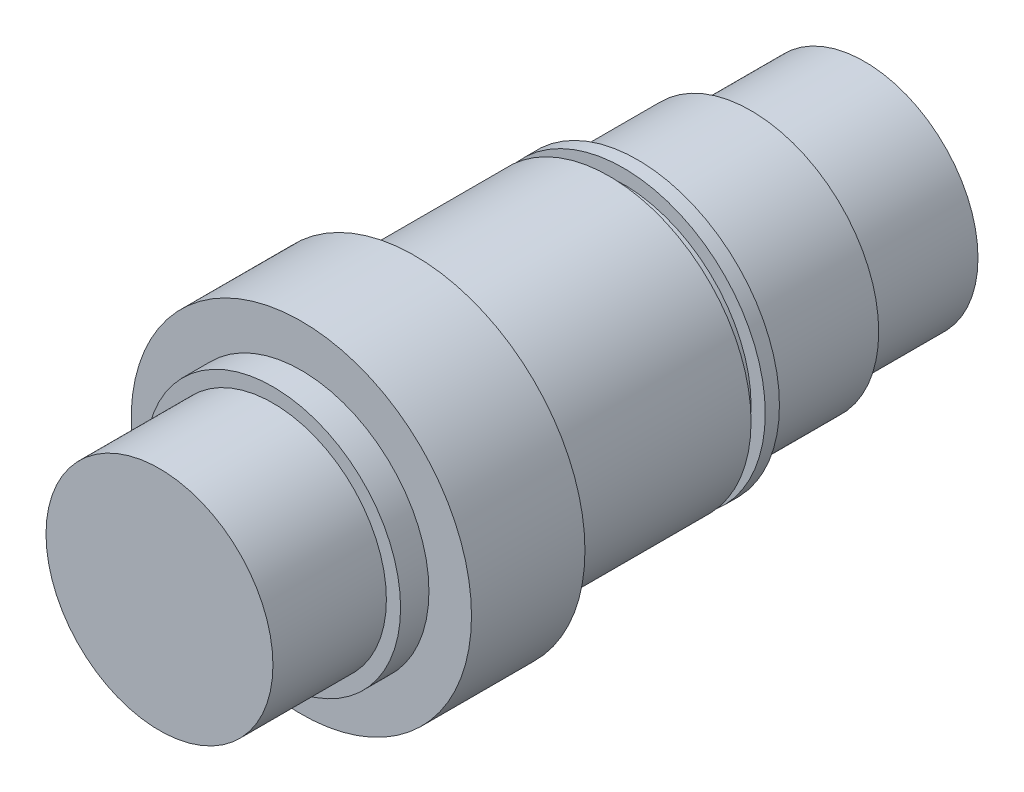
ISO-10303-21;
HEADER;
FILE_DESCRIPTION(('STEP AP214'),'2;1');
FILE_NAME('part.step','',(''),(''),'','','');
FILE_SCHEMA(('AUTOMOTIVE_DESIGN { 1 0 10303 214 1 1 1 1 }'));
ENDSEC;
DATA;
#1=APPLICATION_CONTEXT('core data for automotive mechanical design processes');
#2=APPLICATION_PROTOCOL_DEFINITION('international standard','automotive_design',2000,#1);
#3=PRODUCT_CONTEXT('',#1,'mechanical');
#4=PRODUCT('Part','Part','',(#3));
#5=PRODUCT_RELATED_PRODUCT_CATEGORY('part','',(#4));
#6=PRODUCT_DEFINITION_FORMATION('','',#4);
#7=PRODUCT_DEFINITION_CONTEXT('part definition',#1,'design');
#8=PRODUCT_DEFINITION('design','',#6,#7);
#9=PRODUCT_DEFINITION_SHAPE('','',#8);
#10=(LENGTH_UNIT() NAMED_UNIT(*) SI_UNIT(.MILLI.,.METRE.));
#11=(NAMED_UNIT(*) PLANE_ANGLE_UNIT() SI_UNIT($,.RADIAN.));
#12=(NAMED_UNIT(*) SI_UNIT($,.STERADIAN.) SOLID_ANGLE_UNIT());
#13=UNCERTAINTY_MEASURE_WITH_UNIT(LENGTH_MEASURE(1.E-05),#10,'distance_accuracy_value','');
#14=(GEOMETRIC_REPRESENTATION_CONTEXT(3) GLOBAL_UNCERTAINTY_ASSIGNED_CONTEXT((#13)) GLOBAL_UNIT_ASSIGNED_CONTEXT((#10,
#11,#12)) REPRESENTATION_CONTEXT('',''));
#15=CARTESIAN_POINT('',(0.,0.,0.));
#16=DIRECTION('',(0.,0.,1.));
#17=DIRECTION('',(1.,0.,0.));
#18=AXIS2_PLACEMENT_3D('',#15,#16,#17);
#19=CARTESIAN_POINT('',(0.,0.,25.4));
#20=DIRECTION('',(0.,0.,-1.));
#21=DIRECTION('',(-1.,0.,0.));
#22=AXIS2_PLACEMENT_3D('',#19,#20,#21);
#23=CYLINDRICAL_SURFACE('',#22,25.4);
#24=CARTESIAN_POINT('',(0.,0.,25.4));
#25=DIRECTION('',(0.,0.,1.));
#26=DIRECTION('',(1.,0.,0.));
#27=AXIS2_PLACEMENT_3D('',#24,#25,#26);
#28=CIRCLE('',#27,25.4);
#29=CARTESIAN_POINT('',(25.4,0.,25.4));
#30=VERTEX_POINT('',#29);
#31=EDGE_CURVE('E158',#30,#30,#28,.T.);
#32=ORIENTED_EDGE('',*,*,#31,.F.);
#33=EDGE_LOOP('',(#32));
#34=FACE_BOUND('',#33,.T.);
#35=CARTESIAN_POINT('',(0.,0.,0.));
#36=DIRECTION('',(0.,0.,1.));
#37=DIRECTION('',(1.,0.,0.));
#38=AXIS2_PLACEMENT_3D('',#35,#36,#37);
#39=CIRCLE('',#38,25.4);
#40=CARTESIAN_POINT('',(25.4,0.,0.));
#41=VERTEX_POINT('',#40);
#42=EDGE_CURVE('E171',#41,#41,#39,.T.);
#43=ORIENTED_EDGE('',*,*,#42,.T.);
#44=EDGE_LOOP('',(#43));
#45=FACE_BOUND('',#44,.T.);
#46=ADVANCED_FACE('F39',(#34,#45),#23,.T.);
#47=CARTESIAN_POINT('',(0.,0.,0.));
#48=DIRECTION('',(0.,0.,1.));
#49=DIRECTION('',(1.,0.,0.));
#50=AXIS2_PLACEMENT_3D('',#47,#48,#49);
#51=PLANE('',#50);
#52=ORIENTED_EDGE('',*,*,#42,.F.);
#53=EDGE_LOOP('',(#52));
#54=FACE_BOUND('',#53,.T.);
#55=ADVANCED_FACE('F248',(#54),#51,.F.);
#56=CARTESIAN_POINT('',(0.,0.,50.8));
#57=DIRECTION('',(0.,0.,-1.));
#58=DIRECTION('',(-1.,0.,0.));
#59=AXIS2_PLACEMENT_3D('',#56,#57,#58);
#60=CYLINDRICAL_SURFACE('',#59,28.575);
#61=CARTESIAN_POINT('',(0.,0.,50.8));
#62=DIRECTION('',(0.,0.,1.));
#63=DIRECTION('',(1.,0.,0.));
#64=AXIS2_PLACEMENT_3D('',#61,#62,#63);
#65=CIRCLE('',#64,28.575);
#66=CARTESIAN_POINT('',(28.575,0.,50.8));
#67=VERTEX_POINT('',#66);
#68=EDGE_CURVE('E167',#67,#67,#65,.T.);
#69=ORIENTED_EDGE('',*,*,#68,.F.);
#70=EDGE_LOOP('',(#69));
#71=FACE_BOUND('',#70,.T.);
#72=CARTESIAN_POINT('',(0.,0.,25.4));
#73=DIRECTION('',(0.,0.,1.));
#74=DIRECTION('',(1.,0.,0.));
#75=AXIS2_PLACEMENT_3D('',#72,#73,#74);
#76=CIRCLE('',#75,28.575);
#77=CARTESIAN_POINT('',(28.575,0.,25.4));
#78=VERTEX_POINT('',#77);
#79=EDGE_CURVE('E163',#78,#78,#76,.T.);
#80=ORIENTED_EDGE('',*,*,#79,.T.);
#81=EDGE_LOOP('',(#80));
#82=FACE_BOUND('',#81,.T.);
#83=ADVANCED_FACE('F253',(#71,#82),#60,.T.);
#84=CARTESIAN_POINT('',(0.,0.,25.4));
#85=DIRECTION('',(0.,0.,1.));
#86=DIRECTION('',(1.,0.,0.));
#87=AXIS2_PLACEMENT_3D('',#84,#85,#86);
#88=PLANE('',#87);
#89=ORIENTED_EDGE('',*,*,#31,.T.);
#90=EDGE_LOOP('',(#89));
#91=FACE_BOUND('',#90,.T.);
#92=ORIENTED_EDGE('',*,*,#79,.F.);
#93=EDGE_LOOP('',(#92));
#94=FACE_BOUND('',#93,.T.);
#95=ADVANCED_FACE('F259',(#91,#94),#88,.F.);
#96=CARTESIAN_POINT('',(0.,0.,53.975));
#97=DIRECTION('',(0.,0.,-1.));
#98=DIRECTION('',(-1.,0.,0.));
#99=AXIS2_PLACEMENT_3D('',#96,#97,#98);
#100=CYLINDRICAL_SURFACE('',#99,31.75);
#101=CARTESIAN_POINT('',(0.,0.,53.975));
#102=DIRECTION('',(0.,0.,1.));
#103=DIRECTION('',(1.,0.,0.));
#104=AXIS2_PLACEMENT_3D('',#101,#102,#103);
#105=CIRCLE('',#104,31.75);
#106=CARTESIAN_POINT('',(31.75,0.,53.975));
#107=VERTEX_POINT('',#106);
#108=EDGE_CURVE('E159',#107,#107,#105,.T.);
#109=ORIENTED_EDGE('',*,*,#108,.F.);
#110=EDGE_LOOP('',(#109));
#111=FACE_BOUND('',#110,.T.);
#112=CARTESIAN_POINT('',(0.,0.,50.8));
#113=DIRECTION('',(0.,0.,1.));
#114=DIRECTION('',(1.,0.,0.));
#115=AXIS2_PLACEMENT_3D('',#112,#113,#114);
#116=CIRCLE('',#115,31.75);
#117=CARTESIAN_POINT('',(31.75,0.,50.8));
#118=VERTEX_POINT('',#117);
#119=EDGE_CURVE('E154',#118,#118,#116,.T.);
#120=ORIENTED_EDGE('',*,*,#119,.T.);
#121=EDGE_LOOP('',(#120));
#122=FACE_BOUND('',#121,.T.);
#123=ADVANCED_FACE('F262',(#111,#122),#100,.T.);
#124=CARTESIAN_POINT('',(0.,0.,53.975));
#125=DIRECTION('',(0.,0.,1.));
#126=DIRECTION('',(1.,0.,0.));
#127=AXIS2_PLACEMENT_3D('',#124,#125,#126);
#128=PLANE('',#127);
#129=CARTESIAN_POINT('',(0.,0.,53.975));
#130=DIRECTION('',(0.,0.,1.));
#131=DIRECTION('',(1.,0.,0.));
#132=AXIS2_PLACEMENT_3D('',#129,#130,#131);
#133=CIRCLE('',#132,28.575);
#134=CARTESIAN_POINT('',(28.575,0.,53.975));
#135=VERTEX_POINT('',#134);
#136=EDGE_CURVE('E134',#135,#135,#133,.T.);
#137=ORIENTED_EDGE('',*,*,#136,.F.);
#138=EDGE_LOOP('',(#137));
#139=FACE_BOUND('',#138,.T.);
#140=ORIENTED_EDGE('',*,*,#108,.T.);
#141=EDGE_LOOP('',(#140));
#142=FACE_BOUND('',#141,.T.);
#143=ADVANCED_FACE('F275',(#139,#142),#128,.T.);
#144=CARTESIAN_POINT('',(0.,0.,50.8));
#145=DIRECTION('',(0.,0.,1.));
#146=DIRECTION('',(1.,0.,0.));
#147=AXIS2_PLACEMENT_3D('',#144,#145,#146);
#148=PLANE('',#147);
#149=ORIENTED_EDGE('',*,*,#68,.T.);
#150=EDGE_LOOP('',(#149));
#151=FACE_BOUND('',#150,.T.);
#152=ORIENTED_EDGE('',*,*,#119,.F.);
#153=EDGE_LOOP('',(#152));
#154=FACE_BOUND('',#153,.T.);
#155=ADVANCED_FACE('F277',(#151,#154),#148,.F.);
#156=CARTESIAN_POINT('',(0.,0.,57.15));
#157=DIRECTION('',(0.,0.,-1.));
#158=DIRECTION('',(-1.,0.,0.));
#159=AXIS2_PLACEMENT_3D('',#156,#157,#158);
#160=CYLINDRICAL_SURFACE('',#159,28.575);
#161=CARTESIAN_POINT('',(0.,0.,57.15));
#162=DIRECTION('',(0.,0.,1.));
#163=DIRECTION('',(1.,0.,0.));
#164=AXIS2_PLACEMENT_3D('',#161,#162,#163);
#165=CIRCLE('',#164,28.575);
#166=CARTESIAN_POINT('',(28.575,0.,57.15));
#167=VERTEX_POINT('',#166);
#168=EDGE_CURVE('E147',#167,#167,#165,.T.);
#169=ORIENTED_EDGE('',*,*,#168,.F.);
#170=EDGE_LOOP('',(#169));
#171=FACE_BOUND('',#170,.T.);
#172=ORIENTED_EDGE('',*,*,#136,.T.);
#173=EDGE_LOOP('',(#172));
#174=FACE_BOUND('',#173,.T.);
#175=ADVANCED_FACE('F244',(#171,#174),#160,.T.);
#176=CARTESIAN_POINT('',(0.,0.,100.6856));
#177=DIRECTION('',(0.,0.,-1.));
#178=DIRECTION('',(-1.,0.,0.));
#179=AXIS2_PLACEMENT_3D('',#176,#177,#178);
#180=CYLINDRICAL_SURFACE('',#179,31.75);
#181=DIRECTION('',(0.,0.,-1.));
#182=VECTOR('',#181,1.);
#183=CARTESIAN_POINT('',(-3.175,-31.5908511281352,100.6856));
#184=LINE('',#183,#182);
#185=CARTESIAN_POINT('',(-3.175,-31.5908511281352,69.3928));
#186=VERTEX_POINT('',#185);
#187=CARTESIAN_POINT('',(-3.175,-31.5908511281352,88.4428));
#188=VERTEX_POINT('',#187);
#189=EDGE_CURVE('E11',#186,#188,#184,.F.);
#190=ORIENTED_EDGE('',*,*,#189,.T.);
#191=CARTESIAN_POINT('',(-3.175,-31.5908511281352,88.4428));
#192=CARTESIAN_POINT('',(-3.17500881487897,-31.5908474257493,88.5318623785061));
#193=CARTESIAN_POINT('',(-3.17125259793995,-31.591227683093,88.620920396148));
#194=CARTESIAN_POINT('',(-3.15627835846421,-31.5927287616293,88.7983948815491));
#195=CARTESIAN_POINT('',(-3.14506083179008,-31.5938495336089,88.8868113915469));
#196=CARTESIAN_POINT('',(-3.11524575508353,-31.5968029512261,89.0623023342589));
#197=CARTESIAN_POINT('',(-3.09665491480517,-31.5986349496119,89.1493779125943));
#198=CARTESIAN_POINT('',(-3.05224746674096,-31.6029552163415,89.3216240875408));
#199=CARTESIAN_POINT('',(-3.02643091821876,-31.6054434793027,89.4067946997697));
#200=CARTESIAN_POINT('',(-2.93836379059337,-31.6137952799228,89.6586119347716));
#201=CARTESIAN_POINT('',(-2.86548029919373,-31.6205474551632,89.8216542406984));
#202=CARTESIAN_POINT('',(-2.69355743244421,-31.6356546084346,90.133082362152));
#203=CARTESIAN_POINT('',(-2.59452120862779,-31.6440093933102,90.2814699406877));
#204=CARTESIAN_POINT('',(-2.37270038529664,-31.6614146203797,90.5600382760514));
#205=CARTESIAN_POINT('',(-2.24984216959045,-31.6704671651954,90.6901603815903));
#206=CARTESIAN_POINT('',(-1.98401421029464,-31.6882296344104,90.9279822920232));
#207=CARTESIAN_POINT('',(-1.84104140978468,-31.696939506474,91.0356786825807));
#208=CARTESIAN_POINT('',(-1.53868425335487,-31.7130554028038,91.2257891136511));
#209=CARTESIAN_POINT('',(-1.37926647689543,-31.7204586855965,91.308150258622));
#210=CARTESIAN_POINT('',(-1.0487873332378,-31.7331035052658,91.4449070011667));
#211=CARTESIAN_POINT('',(-0.877726952001583,-31.7383452249312,91.4993049634933));
#212=CARTESIAN_POINT('',(-0.529416830646961,-31.7460618906746,91.5784228400422));
#213=CARTESIAN_POINT('',(-0.352189722893885,-31.7485460385329,91.6032414784736));
#214=CARTESIAN_POINT('',(0.0039349705350569,-31.7504989828503,91.6228016154641));
#215=CARTESIAN_POINT('',(0.182832553703411,-31.7499677838349,91.6175431591641));
#216=CARTESIAN_POINT('',(0.53654002547762,-31.7459573091347,91.5771774998041));
#217=CARTESIAN_POINT('',(0.711362264244053,-31.7424886038786,91.5421773188972));
#218=CARTESIAN_POINT('',(1.05263772978822,-31.7330051242098,91.4434885841135));
#219=CARTESIAN_POINT('',(1.21909088972631,-31.7269903294665,91.3797998011557));
#220=CARTESIAN_POINT('',(1.53924457354879,-31.7130726091693,91.2254230514226));
#221=CARTESIAN_POINT('',(1.69292184964974,-31.7051663389042,91.1346871863632));
#222=CARTESIAN_POINT('',(1.98290002196818,-31.6883533108981,90.9288306932606));
#223=CARTESIAN_POINT('',(2.11920118349494,-31.6794465684368,90.8137104376047));
#224=CARTESIAN_POINT('',(2.37117491176406,-31.6615869179096,90.5617696397823));
#225=CARTESIAN_POINT('',(2.48675741532123,-31.6526339744226,90.4248590176057));
#226=CARTESIAN_POINT('',(2.6933488964288,-31.6357259239318,90.1334781900116));
#227=CARTESIAN_POINT('',(2.78435039993644,-31.6277711208131,89.979002664091));
#228=CARTESIAN_POINT('',(2.93919346728537,-31.6137583170829,89.6567874489913));
#229=CARTESIAN_POINT('',(3.00301314020445,-31.6077018463284,89.4890371974226));
#230=CARTESIAN_POINT('',(3.10145930744171,-31.598195157069,89.145252707043));
#231=CARTESIAN_POINT('',(3.1361299625858,-31.5947409968858,88.9692314276445));
#232=CARTESIAN_POINT('',(3.16217942144668,-31.5921372588932,88.7337816608191));
#233=CARTESIAN_POINT('',(3.16698952399616,-31.5916552653151,88.675638837754));
#234=CARTESIAN_POINT('',(3.17339547373278,-31.5910125962524,88.5592720905192));
#235=CARTESIAN_POINT('',(3.17499668410782,-31.5908513846314,88.5010484647004));
#236=CARTESIAN_POINT('',(3.175,-31.5908511281352,88.4428));
#237=B_SPLINE_CURVE_WITH_KNOTS('',3,(#191,#192,#193,#194,#195,#196,#197,#198,#199,#200,#201,
#202,#203,#204,#205,#206,#207,#208,#209,#210,#211,#212,#213,#214,#215,#216,#217,#218,#219,#220,
#221,#222,#223,#224,#225,#226,#227,#228,#229,#230,#231,#232,#233,#234,#235,#236),.UNSPECIFIED.,
.F.,.F.,(4,2,2,2,2,2,2,2,2,2,2,2,2,2,2,2,2,2,2,2,2,2,4),(0.,0.267099351401074,0.534180953727033,
0.801020066009562,1.06785698980091,1.60125947323771,2.13459770834882,2.66961115016199,
3.20470598881969,3.74091054542706,4.27706974954858,4.81143440741029,5.34579826327885,
5.87824737569606,6.41070073984197,6.94410269690092,7.47749650867311,8.01315552345519,
8.54897722662462,9.08522964225661,9.62066816278441,9.79563436122141,9.9703078848769),.UNSPECIFIED.);
#238=CARTESIAN_POINT('',(3.175,-31.5908511281352,88.4428));
#239=VERTEX_POINT('',#238);
#240=EDGE_CURVE('E125',#188,#239,#237,.T.);
#241=ORIENTED_EDGE('',*,*,#240,.T.);
#242=DIRECTION('',(0.,0.,-1.));
#243=VECTOR('',#242,1.);
#244=CARTESIAN_POINT('',(3.175,-31.5908511281352,100.6856));
#245=LINE('',#244,#243);
#246=CARTESIAN_POINT('',(3.175,-31.5908511281352,69.3928));
#247=VERTEX_POINT('',#246);
#248=EDGE_CURVE('E47',#239,#247,#245,.T.);
#249=ORIENTED_EDGE('',*,*,#248,.T.);
#250=CARTESIAN_POINT('',(3.175,-31.5908511281352,69.3928));
#251=CARTESIAN_POINT('',(3.17500881487897,-31.5908474257493,69.3037376214939));
#252=CARTESIAN_POINT('',(3.17125259793995,-31.591227683093,69.214679603852));
#253=CARTESIAN_POINT('',(3.15627835846421,-31.5927287616293,69.0372051184508));
#254=CARTESIAN_POINT('',(3.14506083179008,-31.5938495336089,68.9487886084531));
#255=CARTESIAN_POINT('',(3.11524575508353,-31.5968029512261,68.7732976657411));
#256=CARTESIAN_POINT('',(3.09665491480517,-31.5986349496119,68.6862220874056));
#257=CARTESIAN_POINT('',(3.05224746674096,-31.6029552163415,68.5139759124592));
#258=CARTESIAN_POINT('',(3.02643091821876,-31.6054434793027,68.4288053002303));
#259=CARTESIAN_POINT('',(2.93836379059337,-31.6137952799228,68.1769880652283));
#260=CARTESIAN_POINT('',(2.86548029919373,-31.6205474551632,68.0139457593016));
#261=CARTESIAN_POINT('',(2.69355743244421,-31.6356546084346,67.7025176378479));
#262=CARTESIAN_POINT('',(2.59452120862779,-31.6440093933102,67.5541300593123));
#263=CARTESIAN_POINT('',(2.37270038529664,-31.6614146203797,67.2755617239486));
#264=CARTESIAN_POINT('',(2.24984216959045,-31.6704671651954,67.1454396184097));
#265=CARTESIAN_POINT('',(1.98401421029464,-31.6882296344104,66.9076177079768));
#266=CARTESIAN_POINT('',(1.84104140978468,-31.696939506474,66.7999213174192));
#267=CARTESIAN_POINT('',(1.53868425335487,-31.7130554028038,66.6098108863489));
#268=CARTESIAN_POINT('',(1.37926647689544,-31.7204586855965,66.527449741378));
#269=CARTESIAN_POINT('',(1.04878733323781,-31.7331035052658,66.3906929988332));
#270=CARTESIAN_POINT('',(0.877726952001585,-31.7383452249312,66.3362950365067));
#271=CARTESIAN_POINT('',(0.52941683064696,-31.7460618906746,66.2571771599578));
#272=CARTESIAN_POINT('',(0.352189722893884,-31.7485460385329,66.2323585215264));
#273=CARTESIAN_POINT('',(-0.0039349705350573,-31.7504989828503,66.2127983845358));
#274=CARTESIAN_POINT('',(-0.182832553703412,-31.7499677838349,66.2180568408359));
#275=CARTESIAN_POINT('',(-0.536540025477622,-31.7459573091347,66.2584225001959));
#276=CARTESIAN_POINT('',(-0.711362264244056,-31.7424886038786,66.2934226811028));
#277=CARTESIAN_POINT('',(-1.05263772978822,-31.7330051242098,66.3921114158865));
#278=CARTESIAN_POINT('',(-1.21909088972631,-31.7269903294665,66.4558001988443));
#279=CARTESIAN_POINT('',(-1.53924457354879,-31.7130726091693,66.6101769485774));
#280=CARTESIAN_POINT('',(-1.69292184964974,-31.7051663389042,66.7009128136368));
#281=CARTESIAN_POINT('',(-1.98290002196818,-31.6883533108981,66.9067693067394));
#282=CARTESIAN_POINT('',(-2.11920118349494,-31.6794465684368,67.0218895623952));
#283=CARTESIAN_POINT('',(-2.37117491176406,-31.6615869179096,67.2738303602177));
#284=CARTESIAN_POINT('',(-2.48675741532123,-31.6526339744226,67.4107409823942));
#285=CARTESIAN_POINT('',(-2.6933488964288,-31.6357259239318,67.7021218099884));
#286=CARTESIAN_POINT('',(-2.78435039993644,-31.6277711208131,67.856597335909));
#287=CARTESIAN_POINT('',(-2.93919346728537,-31.6137583170829,68.1788125510086));
#288=CARTESIAN_POINT('',(-3.00301314020445,-31.6077018463284,68.3465628025773));
#289=CARTESIAN_POINT('',(-3.10145930744171,-31.598195157069,68.690347292957));
#290=CARTESIAN_POINT('',(-3.1361299625858,-31.5947409968858,68.8663685723555));
#291=CARTESIAN_POINT('',(-3.16217942144668,-31.5921372588932,69.1018183391809));
#292=CARTESIAN_POINT('',(-3.16698952399616,-31.5916552653151,69.1599611622459));
#293=CARTESIAN_POINT('',(-3.17339547373278,-31.5910125962524,69.2763279094808));
#294=CARTESIAN_POINT('',(-3.17499668410782,-31.5908513846314,69.3345515352995));
#295=CARTESIAN_POINT('',(-3.175,-31.5908511281352,69.3928));
#296=B_SPLINE_CURVE_WITH_KNOTS('',3,(#250,#251,#252,#253,#254,#255,#256,#257,#258,#259,#260,
#261,#262,#263,#264,#265,#266,#267,#268,#269,#270,#271,#272,#273,#274,#275,#276,#277,#278,#279,
#280,#281,#282,#283,#284,#285,#286,#287,#288,#289,#290,#291,#292,#293,#294,#295),.UNSPECIFIED.,
.F.,.F.,(4,2,2,2,2,2,2,2,2,2,2,2,2,2,2,2,2,2,2,2,2,2,4),(0.,0.267099351401074,0.534180953727033,
0.801020066009562,1.06785698980091,1.60125947323771,2.13459770834882,2.66961115016199,
3.20470598881969,3.74091054542706,4.27706974954858,4.81143440741029,5.34579826327885,
5.87824737569607,6.41070073984197,6.94410269690092,7.47749650867311,8.01315552345519,
8.54897722662462,9.08522964225661,9.62066816278441,9.79563436122141,9.9703078848769),.UNSPECIFIED.);
#297=EDGE_CURVE('E54',#247,#186,#296,.T.);
#298=ORIENTED_EDGE('',*,*,#297,.T.);
#299=EDGE_LOOP('',(#190,#241,#249,#298));
#300=FACE_BOUND('',#299,.T.);
#301=CARTESIAN_POINT('',(0.,0.,100.6856));
#302=DIRECTION('',(0.,0.,1.));
#303=DIRECTION('',(1.,0.,0.));
#304=AXIS2_PLACEMENT_3D('',#301,#302,#303);
#305=CIRCLE('',#304,31.75);
#306=CARTESIAN_POINT('',(31.75,0.,100.6856));
#307=VERTEX_POINT('',#306);
#308=EDGE_CURVE('E143',#307,#307,#305,.T.);
#309=ORIENTED_EDGE('',*,*,#308,.F.);
#310=EDGE_LOOP('',(#309));
#311=FACE_BOUND('',#310,.T.);
#312=CARTESIAN_POINT('',(0.,0.,57.15));
#313=DIRECTION('',(0.,0.,1.));
#314=DIRECTION('',(1.,0.,0.));
#315=AXIS2_PLACEMENT_3D('',#312,#313,#314);
#316=CIRCLE('',#315,31.75);
#317=CARTESIAN_POINT('',(31.75,0.,57.15));
#318=VERTEX_POINT('',#317);
#319=EDGE_CURVE('E139',#318,#318,#316,.T.);
#320=ORIENTED_EDGE('',*,*,#319,.T.);
#321=EDGE_LOOP('',(#320));
#322=FACE_BOUND('',#321,.T.);
#323=ADVANCED_FACE('F195',(#300,#311,#322),#180,.T.);
#324=CARTESIAN_POINT('',(0.,0.,57.15));
#325=DIRECTION('',(0.,0.,1.));
#326=DIRECTION('',(1.,0.,0.));
#327=AXIS2_PLACEMENT_3D('',#324,#325,#326);
#328=PLANE('',#327);
#329=ORIENTED_EDGE('',*,*,#168,.T.);
#330=EDGE_LOOP('',(#329));
#331=FACE_BOUND('',#330,.T.);
#332=ORIENTED_EDGE('',*,*,#319,.F.);
#333=EDGE_LOOP('',(#332));
#334=FACE_BOUND('',#333,.T.);
#335=ADVANCED_FACE('F237',(#331,#334),#328,.F.);
#336=CARTESIAN_POINT('',(0.,0.,126.0856));
#337=DIRECTION('',(0.,0.,-1.));
#338=DIRECTION('',(-1.,0.,0.));
#339=AXIS2_PLACEMENT_3D('',#336,#337,#338);
#340=CYLINDRICAL_SURFACE('',#339,38.1);
#341=CARTESIAN_POINT('',(0.,0.,126.0856));
#342=DIRECTION('',(0.,0.,1.));
#343=DIRECTION('',(1.,0.,0.));
#344=AXIS2_PLACEMENT_3D('',#341,#342,#343);
#345=CIRCLE('',#344,38.1);
#346=CARTESIAN_POINT('',(38.1,0.,126.0856));
#347=VERTEX_POINT('',#346);
#348=EDGE_CURVE('E135',#347,#347,#345,.T.);
#349=ORIENTED_EDGE('',*,*,#348,.F.);
#350=EDGE_LOOP('',(#349));
#351=FACE_BOUND('',#350,.T.);
#352=CARTESIAN_POINT('',(0.,0.,100.6856));
#353=DIRECTION('',(0.,0.,1.));
#354=DIRECTION('',(1.,0.,0.));
#355=AXIS2_PLACEMENT_3D('',#352,#353,#354);
#356=CIRCLE('',#355,38.1);
#357=CARTESIAN_POINT('',(38.1,0.,100.6856));
#358=VERTEX_POINT('',#357);
#359=EDGE_CURVE('E130',#358,#358,#356,.T.);
#360=ORIENTED_EDGE('',*,*,#359,.T.);
#361=EDGE_LOOP('',(#360));
#362=FACE_BOUND('',#361,.T.);
#363=ADVANCED_FACE('F231',(#351,#362),#340,.T.);
#364=CARTESIAN_POINT('',(0.,0.,126.0856));
#365=DIRECTION('',(0.,0.,1.));
#366=DIRECTION('',(1.,0.,0.));
#367=AXIS2_PLACEMENT_3D('',#364,#365,#366);
#368=PLANE('',#367);
#369=CARTESIAN_POINT('',(0.,0.,126.0856));
#370=DIRECTION('',(0.,0.,1.));
#371=DIRECTION('',(1.,0.,0.));
#372=AXIS2_PLACEMENT_3D('',#369,#370,#371);
#373=CIRCLE('',#372,28.575);
#374=CARTESIAN_POINT('',(28.575,0.,126.0856));
#375=VERTEX_POINT('',#374);
#376=EDGE_CURVE('E126',#375,#375,#373,.T.);
#377=ORIENTED_EDGE('',*,*,#376,.F.);
#378=EDGE_LOOP('',(#377));
#379=FACE_BOUND('',#378,.T.);
#380=ORIENTED_EDGE('',*,*,#348,.T.);
#381=EDGE_LOOP('',(#380));
#382=FACE_BOUND('',#381,.T.);
#383=ADVANCED_FACE('F228',(#379,#382),#368,.T.);
#384=CARTESIAN_POINT('',(0.,0.,100.6856));
#385=DIRECTION('',(0.,0.,1.));
#386=DIRECTION('',(1.,0.,0.));
#387=AXIS2_PLACEMENT_3D('',#384,#385,#386);
#388=PLANE('',#387);
#389=ORIENTED_EDGE('',*,*,#308,.T.);
#390=EDGE_LOOP('',(#389));
#391=FACE_BOUND('',#390,.T.);
#392=ORIENTED_EDGE('',*,*,#359,.F.);
#393=EDGE_LOOP('',(#392));
#394=FACE_BOUND('',#393,.T.);
#395=ADVANCED_FACE('F226',(#391,#394),#388,.F.);
#396=CARTESIAN_POINT('',(0.,0.,132.4356));
#397=DIRECTION('',(0.,0.,-1.));
#398=DIRECTION('',(-1.,0.,0.));
#399=AXIS2_PLACEMENT_3D('',#396,#397,#398);
#400=CYLINDRICAL_SURFACE('',#399,28.575);
#401=CARTESIAN_POINT('',(0.,0.,132.4356));
#402=DIRECTION('',(0.,0.,1.));
#403=DIRECTION('',(1.,0.,0.));
#404=AXIS2_PLACEMENT_3D('',#401,#402,#403);
#405=CIRCLE('',#404,28.575);
#406=CARTESIAN_POINT('',(28.575,0.,132.4356));
#407=VERTEX_POINT('',#406);
#408=EDGE_CURVE('E120',#407,#407,#405,.T.);
#409=ORIENTED_EDGE('',*,*,#408,.F.);
#410=EDGE_LOOP('',(#409));
#411=FACE_BOUND('',#410,.T.);
#412=ORIENTED_EDGE('',*,*,#376,.T.);
#413=EDGE_LOOP('',(#412));
#414=FACE_BOUND('',#413,.T.);
#415=ADVANCED_FACE('F222',(#411,#414),#400,.T.);
#416=CARTESIAN_POINT('',(0.,0.,132.4356));
#417=DIRECTION('',(0.,0.,1.));
#418=DIRECTION('',(1.,0.,0.));
#419=AXIS2_PLACEMENT_3D('',#416,#417,#418);
#420=PLANE('',#419);
#421=CARTESIAN_POINT('',(0.,0.,132.4356));
#422=DIRECTION('',(0.,0.,1.));
#423=DIRECTION('',(1.,0.,0.));
#424=AXIS2_PLACEMENT_3D('',#421,#422,#423);
#425=CIRCLE('',#424,25.4);
#426=CARTESIAN_POINT('',(25.4,0.,132.4356));
#427=VERTEX_POINT('',#426);
#428=EDGE_CURVE('E121',#427,#427,#425,.T.);
#429=ORIENTED_EDGE('',*,*,#428,.F.);
#430=EDGE_LOOP('',(#429));
#431=FACE_BOUND('',#430,.T.);
#432=ORIENTED_EDGE('',*,*,#408,.T.);
#433=EDGE_LOOP('',(#432));
#434=FACE_BOUND('',#433,.T.);
#435=ADVANCED_FACE('F218',(#431,#434),#420,.T.);
#436=CARTESIAN_POINT('',(0.,0.,157.8356));
#437=DIRECTION('',(0.,0.,-1.));
#438=DIRECTION('',(-1.,0.,0.));
#439=AXIS2_PLACEMENT_3D('',#436,#437,#438);
#440=CYLINDRICAL_SURFACE('',#439,25.4);
#441=CARTESIAN_POINT('',(0.,0.,157.8356));
#442=DIRECTION('',(0.,0.,1.));
#443=DIRECTION('',(1.,0.,0.));
#444=AXIS2_PLACEMENT_3D('',#441,#442,#443);
#445=CIRCLE('',#444,25.4);
#446=CARTESIAN_POINT('',(25.4,0.,157.8356));
#447=VERTEX_POINT('',#446);
#448=EDGE_CURVE('E111',#447,#447,#445,.T.);
#449=ORIENTED_EDGE('',*,*,#448,.F.);
#450=EDGE_LOOP('',(#449));
#451=FACE_BOUND('',#450,.T.);
#452=ORIENTED_EDGE('',*,*,#428,.T.);
#453=EDGE_LOOP('',(#452));
#454=FACE_BOUND('',#453,.T.);
#455=ADVANCED_FACE('F214',(#451,#454),#440,.T.);
#456=CARTESIAN_POINT('',(0.,0.,157.8356));
#457=DIRECTION('',(0.,0.,1.));
#458=DIRECTION('',(1.,0.,0.));
#459=AXIS2_PLACEMENT_3D('',#456,#457,#458);
#460=PLANE('',#459);
#461=ORIENTED_EDGE('',*,*,#448,.T.);
#462=EDGE_LOOP('',(#461));
#463=FACE_BOUND('',#462,.T.);
#464=ADVANCED_FACE('F211',(#463),#460,.T.);
#465=CARTESIAN_POINT('',(0.,-28.575,69.3928));
#466=DIRECTION('',(0.,-1.,0.));
#467=DIRECTION('',(0.,0.,-1.));
#468=AXIS2_PLACEMENT_3D('',#465,#466,#467);
#469=CYLINDRICAL_SURFACE('',#468,3.175);
#470=DIRECTION('',(0.,-1.,0.));
#471=VECTOR('',#470,1.);
#472=CARTESIAN_POINT('',(3.175,-28.575,69.3928));
#473=LINE('',#472,#471);
#474=CARTESIAN_POINT('',(3.175,-28.575,69.3928));
#475=VERTEX_POINT('',#474);
#476=EDGE_CURVE('E77',#475,#247,#473,.T.);
#477=ORIENTED_EDGE('',*,*,#476,.F.);
#478=CARTESIAN_POINT('',(0.,-28.575,69.3928));
#479=DIRECTION('',(0.,-1.,0.));
#480=DIRECTION('',(0.,0.,-1.));
#481=AXIS2_PLACEMENT_3D('',#478,#479,#480);
#482=CIRCLE('',#481,3.175);
#483=CARTESIAN_POINT('',(-3.175,-28.575,69.3928));
#484=VERTEX_POINT('',#483);
#485=EDGE_CURVE('E81',#484,#475,#482,.T.);
#486=ORIENTED_EDGE('',*,*,#485,.F.);
#487=DIRECTION('',(0.,-1.,0.));
#488=VECTOR('',#487,1.);
#489=CARTESIAN_POINT('',(-3.175,-28.575,69.3928));
#490=LINE('',#489,#488);
#491=EDGE_CURVE('E108',#484,#186,#490,.T.);
#492=ORIENTED_EDGE('',*,*,#491,.T.);
#493=ORIENTED_EDGE('',*,*,#297,.F.);
#494=EDGE_LOOP('',(#477,#486,#492,#493));
#495=FACE_BOUND('',#494,.T.);
#496=ADVANCED_FACE('F79',(#495),#469,.F.);
#497=CARTESIAN_POINT('',(-3.175,-28.575,69.3928));
#498=DIRECTION('',(-1.,0.,0.));
#499=DIRECTION('',(0.,0.,1.));
#500=AXIS2_PLACEMENT_3D('',#497,#498,#499);
#501=PLANE('',#500);
#502=ORIENTED_EDGE('',*,*,#491,.F.);
#503=DIRECTION('',(0.,0.,-1.));
#504=VECTOR('',#503,1.);
#505=CARTESIAN_POINT('',(-3.175,-28.575,69.3928));
#506=LINE('',#505,#504);
#507=CARTESIAN_POINT('',(-3.175,-28.575,88.4428));
#508=VERTEX_POINT('',#507);
#509=EDGE_CURVE('E87',#508,#484,#506,.T.);
#510=ORIENTED_EDGE('',*,*,#509,.F.);
#511=DIRECTION('',(0.,-1.,0.));
#512=VECTOR('',#511,1.);
#513=CARTESIAN_POINT('',(-3.175,-28.575,88.4428));
#514=LINE('',#513,#512);
#515=EDGE_CURVE('E112',#508,#188,#514,.T.);
#516=ORIENTED_EDGE('',*,*,#515,.T.);
#517=ORIENTED_EDGE('',*,*,#189,.F.);
#518=EDGE_LOOP('',(#502,#510,#516,#517));
#519=FACE_BOUND('',#518,.T.);
#520=ADVANCED_FACE('F204',(#519),#501,.F.);
#521=CARTESIAN_POINT('',(0.,-28.575,88.4428));
#522=DIRECTION('',(0.,-1.,0.));
#523=DIRECTION('',(0.,0.,-1.));
#524=AXIS2_PLACEMENT_3D('',#521,#522,#523);
#525=CYLINDRICAL_SURFACE('',#524,3.175);
#526=ORIENTED_EDGE('',*,*,#515,.F.);
#527=CARTESIAN_POINT('',(0.,-28.575,88.4428));
#528=DIRECTION('',(0.,-1.,0.));
#529=DIRECTION('',(0.,0.,-1.));
#530=AXIS2_PLACEMENT_3D('',#527,#528,#529);
#531=CIRCLE('',#530,3.175);
#532=CARTESIAN_POINT('',(3.175,-28.575,88.4428));
#533=VERTEX_POINT('',#532);
#534=EDGE_CURVE('E97',#533,#508,#531,.T.);
#535=ORIENTED_EDGE('',*,*,#534,.F.);
#536=DIRECTION('',(0.,-1.,0.));
#537=VECTOR('',#536,1.);
#538=CARTESIAN_POINT('',(3.175,-28.575,88.4428));
#539=LINE('',#538,#537);
#540=EDGE_CURVE('E86',#533,#239,#539,.T.);
#541=ORIENTED_EDGE('',*,*,#540,.T.);
#542=ORIENTED_EDGE('',*,*,#240,.F.);
#543=EDGE_LOOP('',(#526,#535,#541,#542));
#544=FACE_BOUND('',#543,.T.);
#545=ADVANCED_FACE('F199',(#544),#525,.F.);
#546=CARTESIAN_POINT('',(3.175,-28.575,69.3928));
#547=DIRECTION('',(1.,0.,0.));
#548=DIRECTION('',(0.,0.,-1.));
#549=AXIS2_PLACEMENT_3D('',#546,#547,#548);
#550=PLANE('',#549);
#551=ORIENTED_EDGE('',*,*,#540,.F.);
#552=DIRECTION('',(0.,0.,1.));
#553=VECTOR('',#552,1.);
#554=CARTESIAN_POINT('',(3.175,-28.575,69.3928));
#555=LINE('',#554,#553);
#556=EDGE_CURVE('E90',#475,#533,#555,.T.);
#557=ORIENTED_EDGE('',*,*,#556,.F.);
#558=ORIENTED_EDGE('',*,*,#476,.T.);
#559=ORIENTED_EDGE('',*,*,#248,.F.);
#560=EDGE_LOOP('',(#551,#557,#558,#559));
#561=FACE_BOUND('',#560,.T.);
#562=ADVANCED_FACE('F91',(#561),#550,.F.);
#563=CARTESIAN_POINT('',(0.,-28.575,69.3928));
#564=DIRECTION('',(0.,-1.,0.));
#565=DIRECTION('',(0.,0.,-1.));
#566=AXIS2_PLACEMENT_3D('',#563,#564,#565);
#567=PLANE('',#566);
#568=ORIENTED_EDGE('',*,*,#485,.T.);
#569=ORIENTED_EDGE('',*,*,#556,.T.);
#570=ORIENTED_EDGE('',*,*,#534,.T.);
#571=ORIENTED_EDGE('',*,*,#509,.T.);
#572=EDGE_LOOP('',(#568,#569,#570,#571));
#573=FACE_BOUND('',#572,.T.);
#574=ADVANCED_FACE('F99',(#573),#567,.T.);
#575=CLOSED_SHELL('',(#46,#55,#83,#95,#123,#143,#155,#175,#323,#335,#363,#383,#395,#415,#435,
#455,#464,#496,#520,#545,#562,#574));
#576=MANIFOLD_SOLID_BREP('B2',#575);
#577=ADVANCED_BREP_SHAPE_REPRESENTATION('',(#18,#576),#14);
#578=SHAPE_DEFINITION_REPRESENTATION(#9,#577);
ENDSEC;
END-ISO-10303-21;
